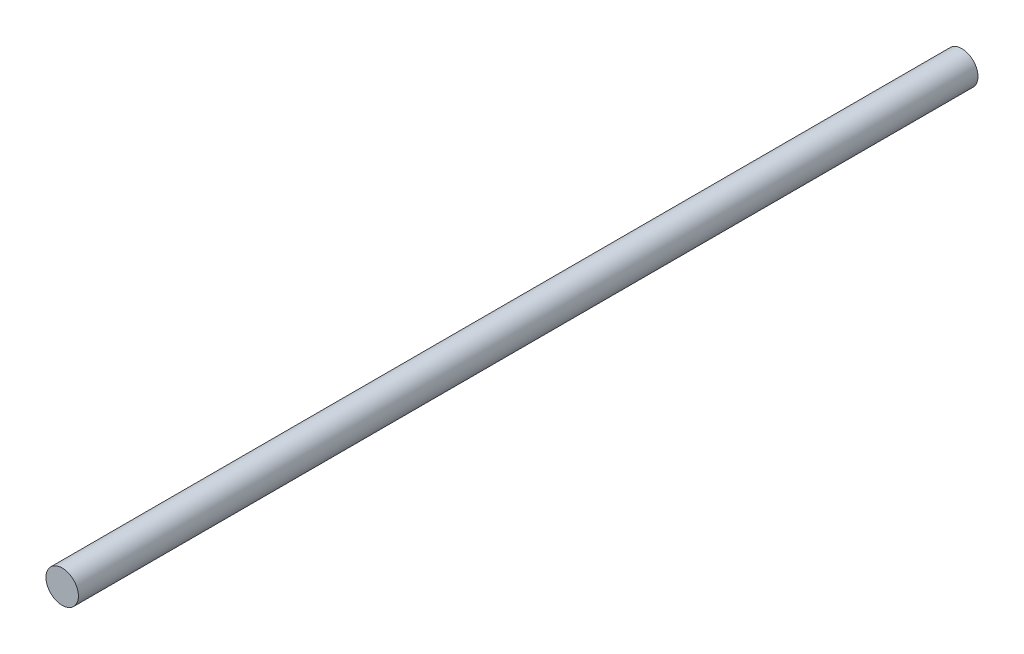
ISO-10303-21;
HEADER;
FILE_DESCRIPTION(('STEP AP214'),'2;1');
FILE_NAME('part.step','',(''),(''),'','','');
FILE_SCHEMA(('AUTOMOTIVE_DESIGN { 1 0 10303 214 1 1 1 1 }'));
ENDSEC;
DATA;
#1=APPLICATION_CONTEXT('core data for automotive mechanical design processes');
#2=APPLICATION_PROTOCOL_DEFINITION('international standard','automotive_design',2000,#1);
#3=PRODUCT_CONTEXT('',#1,'mechanical');
#4=PRODUCT('Part','Part','',(#3));
#5=PRODUCT_RELATED_PRODUCT_CATEGORY('part','',(#4));
#6=PRODUCT_DEFINITION_FORMATION('','',#4);
#7=PRODUCT_DEFINITION_CONTEXT('part definition',#1,'design');
#8=PRODUCT_DEFINITION('design','',#6,#7);
#9=PRODUCT_DEFINITION_SHAPE('','',#8);
#10=(LENGTH_UNIT() NAMED_UNIT(*) SI_UNIT(.MILLI.,.METRE.));
#11=(NAMED_UNIT(*) PLANE_ANGLE_UNIT() SI_UNIT($,.RADIAN.));
#12=(NAMED_UNIT(*) SI_UNIT($,.STERADIAN.) SOLID_ANGLE_UNIT());
#13=UNCERTAINTY_MEASURE_WITH_UNIT(LENGTH_MEASURE(1.E-05),#10,'distance_accuracy_value','');
#14=(GEOMETRIC_REPRESENTATION_CONTEXT(3) GLOBAL_UNCERTAINTY_ASSIGNED_CONTEXT((#13)) GLOBAL_UNIT_ASSIGNED_CONTEXT((#10,
#11,#12)) REPRESENTATION_CONTEXT('',''));
#15=CARTESIAN_POINT('',(0.,0.,0.));
#16=DIRECTION('',(0.,0.,1.));
#17=DIRECTION('',(1.,0.,0.));
#18=AXIS2_PLACEMENT_3D('',#15,#16,#17);
#19=CARTESIAN_POINT('',(0.,0.,277.5));
#20=DIRECTION('',(0.,0.,-1.));
#21=DIRECTION('',(-1.,0.,0.));
#22=AXIS2_PLACEMENT_3D('',#19,#20,#21);
#23=CYLINDRICAL_SURFACE('',#22,5.);
#24=CARTESIAN_POINT('',(0.,0.,277.5));
#25=DIRECTION('',(0.,0.,1.));
#26=DIRECTION('',(1.,0.,0.));
#27=AXIS2_PLACEMENT_3D('',#24,#25,#26);
#28=CIRCLE('',#27,5.);
#29=CARTESIAN_POINT('',(5.,0.,277.5));
#30=VERTEX_POINT('',#29);
#31=EDGE_CURVE('E10',#30,#30,#28,.T.);
#32=ORIENTED_EDGE('',*,*,#31,.F.);
#33=EDGE_LOOP('',(#32));
#34=FACE_BOUND('',#33,.T.);
#35=CARTESIAN_POINT('',(0.,0.,0.));
#36=DIRECTION('',(0.,0.,1.));
#37=DIRECTION('',(1.,0.,0.));
#38=AXIS2_PLACEMENT_3D('',#35,#36,#37);
#39=CIRCLE('',#38,5.);
#40=CARTESIAN_POINT('',(5.,0.,0.));
#41=VERTEX_POINT('',#40);
#42=EDGE_CURVE('E40',#41,#41,#39,.T.);
#43=ORIENTED_EDGE('',*,*,#42,.T.);
#44=EDGE_LOOP('',(#43));
#45=FACE_BOUND('',#44,.T.);
#46=ADVANCED_FACE('F37',(#34,#45),#23,.T.);
#47=CARTESIAN_POINT('',(0.,0.,277.5));
#48=DIRECTION('',(0.,0.,1.));
#49=DIRECTION('',(1.,0.,0.));
#50=AXIS2_PLACEMENT_3D('',#47,#48,#49);
#51=PLANE('',#50);
#52=ORIENTED_EDGE('',*,*,#31,.T.);
#53=EDGE_LOOP('',(#52));
#54=FACE_BOUND('',#53,.T.);
#55=ADVANCED_FACE('F54',(#54),#51,.T.);
#56=CARTESIAN_POINT('',(0.,0.,0.));
#57=DIRECTION('',(0.,0.,1.));
#58=DIRECTION('',(1.,0.,0.));
#59=AXIS2_PLACEMENT_3D('',#56,#57,#58);
#60=PLANE('',#59);
#61=ORIENTED_EDGE('',*,*,#42,.F.);
#62=EDGE_LOOP('',(#61));
#63=FACE_BOUND('',#62,.T.);
#64=ADVANCED_FACE('F52',(#63),#60,.F.);
#65=CLOSED_SHELL('',(#46,#55,#64));
#66=MANIFOLD_SOLID_BREP('B2',#65);
#67=ADVANCED_BREP_SHAPE_REPRESENTATION('',(#18,#66),#14);
#68=SHAPE_DEFINITION_REPRESENTATION(#9,#67);
ENDSEC;
END-ISO-10303-21;
